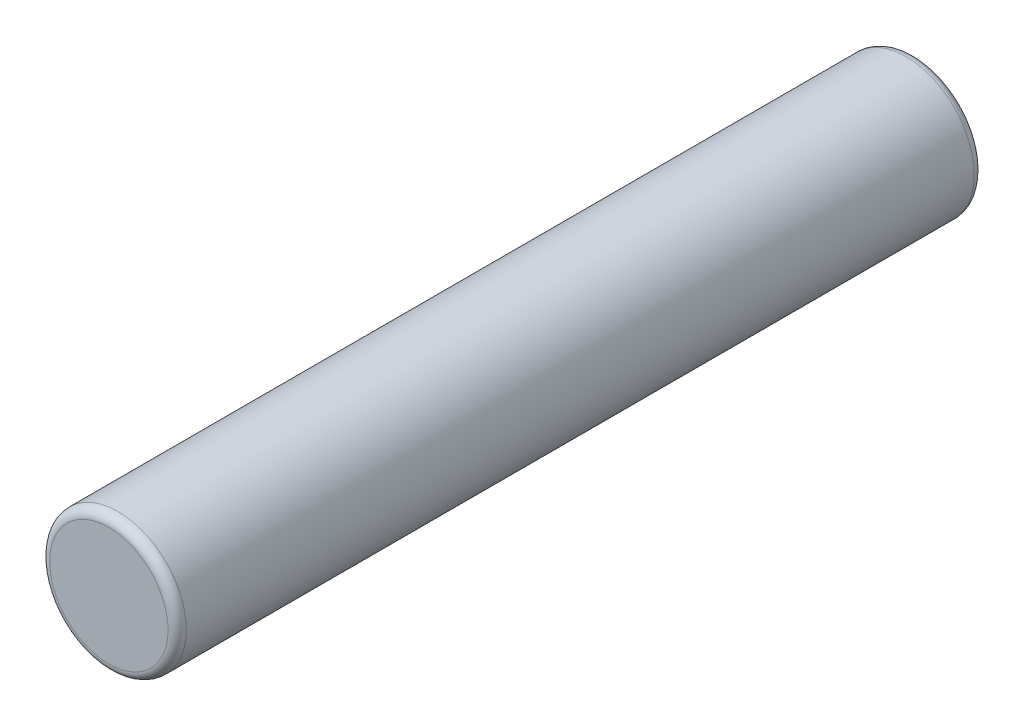
ISO-10303-21;
HEADER;
FILE_DESCRIPTION(('STEP AP214'),'2;1');
FILE_NAME('part.step','',(''),(''),'','','');
FILE_SCHEMA(('AUTOMOTIVE_DESIGN { 1 0 10303 214 1 1 1 1 }'));
ENDSEC;
DATA;
#1=APPLICATION_CONTEXT('core data for automotive mechanical design processes');
#2=APPLICATION_PROTOCOL_DEFINITION('international standard','automotive_design',2000,#1);
#3=PRODUCT_CONTEXT('',#1,'mechanical');
#4=PRODUCT('Part','Part','',(#3));
#5=PRODUCT_RELATED_PRODUCT_CATEGORY('part','',(#4));
#6=PRODUCT_DEFINITION_FORMATION('','',#4);
#7=PRODUCT_DEFINITION_CONTEXT('part definition',#1,'design');
#8=PRODUCT_DEFINITION('design','',#6,#7);
#9=PRODUCT_DEFINITION_SHAPE('','',#8);
#10=(LENGTH_UNIT() NAMED_UNIT(*) SI_UNIT(.MILLI.,.METRE.));
#11=(NAMED_UNIT(*) PLANE_ANGLE_UNIT() SI_UNIT($,.RADIAN.));
#12=(NAMED_UNIT(*) SI_UNIT($,.STERADIAN.) SOLID_ANGLE_UNIT());
#13=UNCERTAINTY_MEASURE_WITH_UNIT(LENGTH_MEASURE(1.E-05),#10,'distance_accuracy_value','');
#14=(GEOMETRIC_REPRESENTATION_CONTEXT(3) GLOBAL_UNCERTAINTY_ASSIGNED_CONTEXT((#13)) GLOBAL_UNIT_ASSIGNED_CONTEXT((#10,
#11,#12)) REPRESENTATION_CONTEXT('',''));
#15=CARTESIAN_POINT('',(0.,0.,0.));
#16=DIRECTION('',(0.,0.,1.));
#17=DIRECTION('',(1.,0.,0.));
#18=AXIS2_PLACEMENT_3D('',#15,#16,#17);
#19=CARTESIAN_POINT('',(0.,0.,17.7));
#20=DIRECTION('',(0.,0.,-1.));
#21=DIRECTION('',(-1.,0.,0.));
#22=AXIS2_PLACEMENT_3D('',#19,#20,#21);
#23=CYLINDRICAL_SURFACE('',#22,1.5);
#24=CARTESIAN_POINT('',(0.,0.,0.199999999999999));
#25=DIRECTION('',(0.,0.,1.));
#26=DIRECTION('',(1.,0.,0.));
#27=AXIS2_PLACEMENT_3D('',#24,#25,#26);
#28=CIRCLE('',#27,1.5);
#29=CARTESIAN_POINT('',(1.5,0.,0.199999999999999));
#30=VERTEX_POINT('',#29);
#31=EDGE_CURVE('E42',#30,#30,#28,.T.);
#32=ORIENTED_EDGE('',*,*,#31,.T.);
#33=EDGE_LOOP('',(#32));
#34=FACE_BOUND('',#33,.T.);
#35=CARTESIAN_POINT('',(0.,0.,17.5));
#36=DIRECTION('',(0.,0.,1.));
#37=DIRECTION('',(1.,0.,0.));
#38=AXIS2_PLACEMENT_3D('',#35,#36,#37);
#39=CIRCLE('',#38,1.5);
#40=CARTESIAN_POINT('',(1.5,0.,17.5));
#41=VERTEX_POINT('',#40);
#42=EDGE_CURVE('E46',#41,#41,#39,.F.);
#43=ORIENTED_EDGE('',*,*,#42,.T.);
#44=EDGE_LOOP('',(#43));
#45=FACE_BOUND('',#44,.T.);
#46=ADVANCED_FACE('F31',(#34,#45),#23,.T.);
#47=CARTESIAN_POINT('',(0.,0.,17.7));
#48=DIRECTION('',(0.,0.,1.));
#49=DIRECTION('',(1.,0.,0.));
#50=AXIS2_PLACEMENT_3D('',#47,#48,#49);
#51=PLANE('',#50);
#52=CARTESIAN_POINT('',(0.,0.,17.7));
#53=DIRECTION('',(0.,0.,1.));
#54=DIRECTION('',(1.,0.,0.));
#55=AXIS2_PLACEMENT_3D('',#52,#53,#54);
#56=CIRCLE('',#55,1.3);
#57=CARTESIAN_POINT('',(1.3,0.,17.7));
#58=VERTEX_POINT('',#57);
#59=EDGE_CURVE('E10',#58,#58,#56,.T.);
#60=ORIENTED_EDGE('',*,*,#59,.T.);
#61=EDGE_LOOP('',(#60));
#62=FACE_BOUND('',#61,.T.);
#63=ADVANCED_FACE('F62',(#62),#51,.T.);
#64=CARTESIAN_POINT('',(0.,0.,0.));
#65=DIRECTION('',(0.,0.,1.));
#66=DIRECTION('',(1.,0.,0.));
#67=AXIS2_PLACEMENT_3D('',#64,#65,#66);
#68=PLANE('',#67);
#69=CARTESIAN_POINT('',(0.,0.,0.));
#70=DIRECTION('',(0.,0.,1.));
#71=DIRECTION('',(1.,0.,0.));
#72=AXIS2_PLACEMENT_3D('',#69,#70,#71);
#73=CIRCLE('',#72,1.3);
#74=CARTESIAN_POINT('',(1.3,0.,0.));
#75=VERTEX_POINT('',#74);
#76=EDGE_CURVE('E38',#75,#75,#73,.F.);
#77=ORIENTED_EDGE('',*,*,#76,.T.);
#78=EDGE_LOOP('',(#77));
#79=FACE_BOUND('',#78,.T.);
#80=ADVANCED_FACE('F59',(#79),#68,.F.);
#81=CARTESIAN_POINT('',(0.,0.,0.199999999999999));
#82=DIRECTION('',(0.,0.,1.));
#83=DIRECTION('',(1.,0.,0.));
#84=AXIS2_PLACEMENT_3D('',#81,#82,#83);
#85=TOROIDAL_SURFACE('',#84,1.3,0.2);
#86=ORIENTED_EDGE('',*,*,#76,.F.);
#87=EDGE_LOOP('',(#86));
#88=FACE_BOUND('',#87,.T.);
#89=ORIENTED_EDGE('',*,*,#31,.F.);
#90=EDGE_LOOP('',(#89));
#91=FACE_BOUND('',#90,.T.);
#92=ADVANCED_FACE('F55',(#88,#91),#85,.T.);
#93=CARTESIAN_POINT('',(0.,0.,17.5));
#94=DIRECTION('',(0.,0.,1.));
#95=DIRECTION('',(1.,0.,0.));
#96=AXIS2_PLACEMENT_3D('',#93,#94,#95);
#97=TOROIDAL_SURFACE('',#96,1.3,0.2);
#98=ORIENTED_EDGE('',*,*,#42,.F.);
#99=EDGE_LOOP('',(#98));
#100=FACE_BOUND('',#99,.T.);
#101=ORIENTED_EDGE('',*,*,#59,.F.);
#102=EDGE_LOOP('',(#101));
#103=FACE_BOUND('',#102,.T.);
#104=ADVANCED_FACE('F33',(#100,#103),#97,.T.);
#105=CLOSED_SHELL('',(#46,#63,#80,#92,#104));
#106=MANIFOLD_SOLID_BREP('B2',#105);
#107=ADVANCED_BREP_SHAPE_REPRESENTATION('',(#18,#106),#14);
#108=SHAPE_DEFINITION_REPRESENTATION(#9,#107);
ENDSEC;
END-ISO-10303-21;
